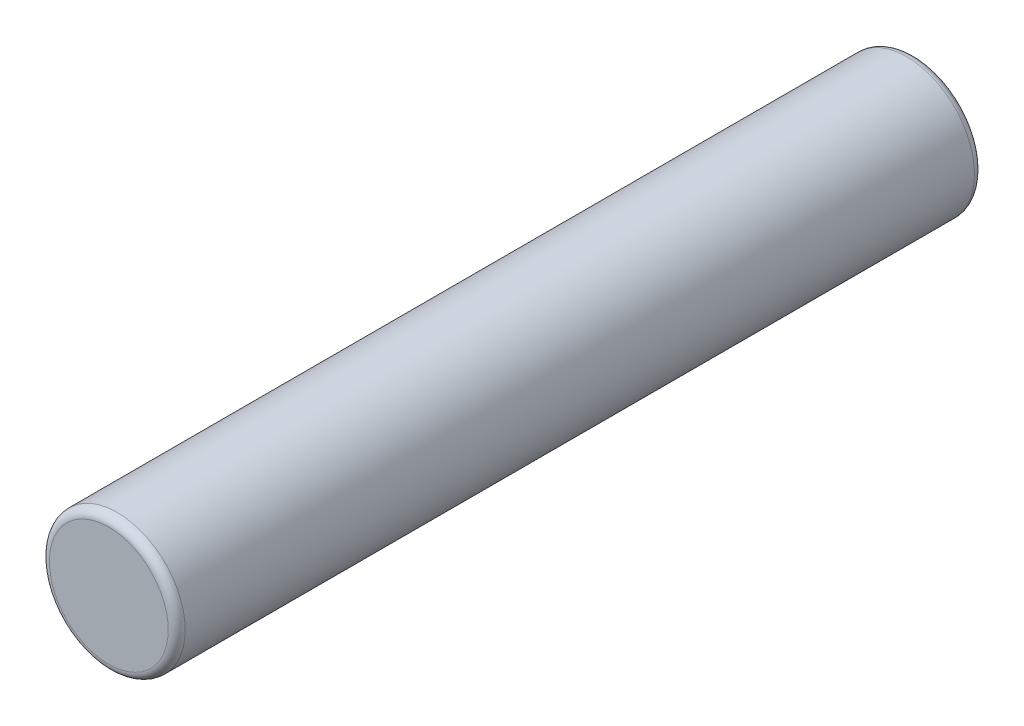
ISO-10303-21;
HEADER;
FILE_DESCRIPTION(('STEP AP214'),'2;1');
FILE_NAME('part.step','',(''),(''),'','','');
FILE_SCHEMA(('AUTOMOTIVE_DESIGN { 1 0 10303 214 1 1 1 1 }'));
ENDSEC;
DATA;
#1=APPLICATION_CONTEXT('core data for automotive mechanical design processes');
#2=APPLICATION_PROTOCOL_DEFINITION('international standard','automotive_design',2000,#1);
#3=PRODUCT_CONTEXT('',#1,'mechanical');
#4=PRODUCT('Part','Part','',(#3));
#5=PRODUCT_RELATED_PRODUCT_CATEGORY('part','',(#4));
#6=PRODUCT_DEFINITION_FORMATION('','',#4);
#7=PRODUCT_DEFINITION_CONTEXT('part definition',#1,'design');
#8=PRODUCT_DEFINITION('design','',#6,#7);
#9=PRODUCT_DEFINITION_SHAPE('','',#8);
#10=(LENGTH_UNIT() NAMED_UNIT(*) SI_UNIT(.MILLI.,.METRE.));
#11=(NAMED_UNIT(*) PLANE_ANGLE_UNIT() SI_UNIT($,.RADIAN.));
#12=(NAMED_UNIT(*) SI_UNIT($,.STERADIAN.) SOLID_ANGLE_UNIT());
#13=UNCERTAINTY_MEASURE_WITH_UNIT(LENGTH_MEASURE(1.E-05),#10,'distance_accuracy_value','');
#14=(GEOMETRIC_REPRESENTATION_CONTEXT(3) GLOBAL_UNCERTAINTY_ASSIGNED_CONTEXT((#13)) GLOBAL_UNIT_ASSIGNED_CONTEXT((#10,
#11,#12)) REPRESENTATION_CONTEXT('',''));
#15=CARTESIAN_POINT('',(0.,0.,0.));
#16=DIRECTION('',(0.,0.,1.));
#17=DIRECTION('',(1.,0.,0.));
#18=AXIS2_PLACEMENT_3D('',#15,#16,#17);
#19=CARTESIAN_POINT('',(0.,0.,9.5));
#20=DIRECTION('',(0.,0.,-1.));
#21=DIRECTION('',(-1.,0.,0.));
#22=AXIS2_PLACEMENT_3D('',#19,#20,#21);
#23=CYLINDRICAL_SURFACE('',#22,0.8);
#24=CARTESIAN_POINT('',(0.,0.,0.0999999999999994));
#25=DIRECTION('',(0.,0.,1.));
#26=DIRECTION('',(1.,0.,0.));
#27=AXIS2_PLACEMENT_3D('',#24,#25,#26);
#28=CIRCLE('',#27,0.8);
#29=CARTESIAN_POINT('',(0.8,0.,0.0999999999999994));
#30=VERTEX_POINT('',#29);
#31=EDGE_CURVE('E50',#30,#30,#28,.T.);
#32=ORIENTED_EDGE('',*,*,#31,.T.);
#33=EDGE_LOOP('',(#32));
#34=FACE_BOUND('',#33,.T.);
#35=CARTESIAN_POINT('',(0.,0.,9.4));
#36=DIRECTION('',(0.,0.,1.));
#37=DIRECTION('',(1.,0.,0.));
#38=AXIS2_PLACEMENT_3D('',#35,#36,#37);
#39=CIRCLE('',#38,0.8);
#40=CARTESIAN_POINT('',(0.8,0.,9.4));
#41=VERTEX_POINT('',#40);
#42=EDGE_CURVE('E55',#41,#41,#39,.F.);
#43=ORIENTED_EDGE('',*,*,#42,.T.);
#44=EDGE_LOOP('',(#43));
#45=FACE_BOUND('',#44,.T.);
#46=ADVANCED_FACE('F37',(#34,#45),#23,.T.);
#47=CARTESIAN_POINT('',(0.,0.,9.5));
#48=DIRECTION('',(0.,0.,1.));
#49=DIRECTION('',(1.,0.,0.));
#50=AXIS2_PLACEMENT_3D('',#47,#48,#49);
#51=PLANE('',#50);
#52=CARTESIAN_POINT('',(0.,0.,9.5));
#53=DIRECTION('',(0.,0.,1.));
#54=DIRECTION('',(1.,0.,0.));
#55=AXIS2_PLACEMENT_3D('',#52,#53,#54);
#56=CIRCLE('',#55,0.7);
#57=CARTESIAN_POINT('',(0.7,0.,9.5));
#58=VERTEX_POINT('',#57);
#59=EDGE_CURVE('E10',#58,#58,#56,.T.);
#60=ORIENTED_EDGE('',*,*,#59,.T.);
#61=EDGE_LOOP('',(#60));
#62=FACE_BOUND('',#61,.T.);
#63=ADVANCED_FACE('F72',(#62),#51,.T.);
#64=CARTESIAN_POINT('',(0.,0.,0.));
#65=DIRECTION('',(0.,0.,1.));
#66=DIRECTION('',(1.,0.,0.));
#67=AXIS2_PLACEMENT_3D('',#64,#65,#66);
#68=PLANE('',#67);
#69=CARTESIAN_POINT('',(0.,0.,0.));
#70=DIRECTION('',(0.,0.,1.));
#71=DIRECTION('',(1.,0.,0.));
#72=AXIS2_PLACEMENT_3D('',#69,#70,#71);
#73=CIRCLE('',#72,0.7);
#74=CARTESIAN_POINT('',(0.7,0.,0.));
#75=VERTEX_POINT('',#74);
#76=EDGE_CURVE('E45',#75,#75,#73,.F.);
#77=ORIENTED_EDGE('',*,*,#76,.T.);
#78=EDGE_LOOP('',(#77));
#79=FACE_BOUND('',#78,.T.);
#80=ADVANCED_FACE('F69',(#79),#68,.F.);
#81=CARTESIAN_POINT('',(0.,0.,0.0999999999999994));
#82=DIRECTION('',(0.,0.,1.));
#83=DIRECTION('',(1.,0.,0.));
#84=AXIS2_PLACEMENT_3D('',#81,#82,#83);
#85=TOROIDAL_SURFACE('',#84,0.7,0.1);
#86=ORIENTED_EDGE('',*,*,#76,.F.);
#87=EDGE_LOOP('',(#86));
#88=FACE_BOUND('',#87,.T.);
#89=ORIENTED_EDGE('',*,*,#31,.F.);
#90=EDGE_LOOP('',(#89));
#91=FACE_BOUND('',#90,.T.);
#92=ADVANCED_FACE('F65',(#88,#91),#85,.T.);
#93=CARTESIAN_POINT('',(0.,0.,9.4));
#94=DIRECTION('',(0.,0.,1.));
#95=DIRECTION('',(1.,0.,0.));
#96=AXIS2_PLACEMENT_3D('',#93,#94,#95);
#97=TOROIDAL_SURFACE('',#96,0.7,0.1);
#98=ORIENTED_EDGE('',*,*,#42,.F.);
#99=EDGE_LOOP('',(#98));
#100=FACE_BOUND('',#99,.T.);
#101=ORIENTED_EDGE('',*,*,#59,.F.);
#102=EDGE_LOOP('',(#101));
#103=FACE_BOUND('',#102,.T.);
#104=ADVANCED_FACE('F39',(#100,#103),#97,.T.);
#105=CLOSED_SHELL('',(#46,#63,#80,#92,#104));
#106=MANIFOLD_SOLID_BREP('B2',#105);
#107=ADVANCED_BREP_SHAPE_REPRESENTATION('',(#18,#106),#14);
#108=SHAPE_DEFINITION_REPRESENTATION(#9,#107);
ENDSEC;
END-ISO-10303-21;
